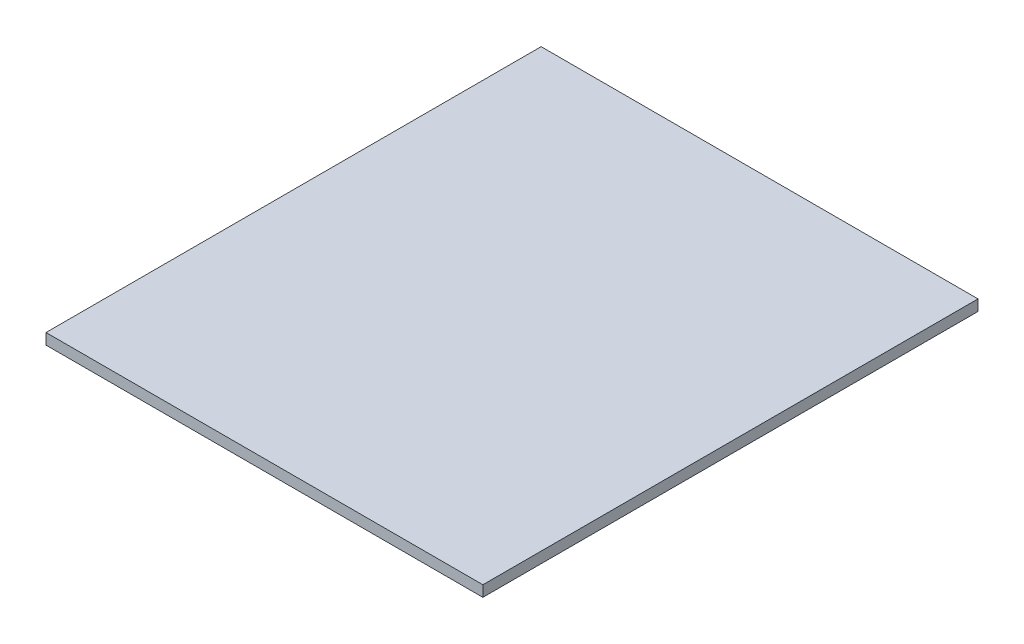
ISO-10303-21;
HEADER;
FILE_DESCRIPTION(('STEP AP214'),'2;1');
FILE_NAME('part.step','',(''),(''),'','','');
FILE_SCHEMA(('AUTOMOTIVE_DESIGN { 1 0 10303 214 1 1 1 1 }'));
ENDSEC;
DATA;
#1=APPLICATION_CONTEXT('core data for automotive mechanical design processes');
#2=APPLICATION_PROTOCOL_DEFINITION('international standard','automotive_design',2000,#1);
#3=PRODUCT_CONTEXT('',#1,'mechanical');
#4=PRODUCT('Part','Part','',(#3));
#5=PRODUCT_RELATED_PRODUCT_CATEGORY('part','',(#4));
#6=PRODUCT_DEFINITION_FORMATION('','',#4);
#7=PRODUCT_DEFINITION_CONTEXT('part definition',#1,'design');
#8=PRODUCT_DEFINITION('design','',#6,#7);
#9=PRODUCT_DEFINITION_SHAPE('','',#8);
#10=(LENGTH_UNIT() NAMED_UNIT(*) SI_UNIT(.MILLI.,.METRE.));
#11=(NAMED_UNIT(*) PLANE_ANGLE_UNIT() SI_UNIT($,.RADIAN.));
#12=(NAMED_UNIT(*) SI_UNIT($,.STERADIAN.) SOLID_ANGLE_UNIT());
#13=UNCERTAINTY_MEASURE_WITH_UNIT(LENGTH_MEASURE(1.E-05),#10,'distance_accuracy_value','');
#14=(GEOMETRIC_REPRESENTATION_CONTEXT(3) GLOBAL_UNCERTAINTY_ASSIGNED_CONTEXT((#13)) GLOBAL_UNIT_ASSIGNED_CONTEXT((#10,
#11,#12)) REPRESENTATION_CONTEXT('',''));
#15=CARTESIAN_POINT('',(0.,0.,0.));
#16=DIRECTION('',(0.,0.,1.));
#17=DIRECTION('',(1.,0.,0.));
#18=AXIS2_PLACEMENT_3D('',#15,#16,#17);
#19=CARTESIAN_POINT('',(0.,3.,0.));
#20=DIRECTION('',(1.,0.,0.));
#21=DIRECTION('',(0.,0.,-1.));
#22=AXIS2_PLACEMENT_3D('',#19,#20,#21);
#23=PLANE('',#22);
#24=DIRECTION('',(0.,0.,1.));
#25=VECTOR('',#24,1.);
#26=CARTESIAN_POINT('',(0.,0.,0.));
#27=LINE('',#26,#25);
#28=CARTESIAN_POINT('',(0.,0.,-136.));
#29=VERTEX_POINT('',#28);
#30=CARTESIAN_POINT('',(0.,0.,0.));
#31=VERTEX_POINT('',#30);
#32=EDGE_CURVE('E96',#29,#31,#27,.T.);
#33=ORIENTED_EDGE('',*,*,#32,.T.);
#34=DIRECTION('',(0.,-1.,0.));
#35=VECTOR('',#34,1.);
#36=CARTESIAN_POINT('',(0.,3.,0.));
#37=LINE('',#36,#35);
#38=CARTESIAN_POINT('',(0.,3.,0.));
#39=VERTEX_POINT('',#38);
#40=EDGE_CURVE('E11',#39,#31,#37,.T.);
#41=ORIENTED_EDGE('',*,*,#40,.F.);
#42=DIRECTION('',(0.,0.,1.));
#43=VECTOR('',#42,1.);
#44=CARTESIAN_POINT('',(0.,3.,0.));
#45=LINE('',#44,#43);
#46=CARTESIAN_POINT('',(0.,3.,-136.));
#47=VERTEX_POINT('',#46);
#48=EDGE_CURVE('E84',#47,#39,#45,.T.);
#49=ORIENTED_EDGE('',*,*,#48,.F.);
#50=DIRECTION('',(0.,-1.,0.));
#51=VECTOR('',#50,1.);
#52=CARTESIAN_POINT('',(0.,3.,-136.));
#53=LINE('',#52,#51);
#54=EDGE_CURVE('E92',#47,#29,#53,.T.);
#55=ORIENTED_EDGE('',*,*,#54,.T.);
#56=EDGE_LOOP('',(#33,#41,#49,#55));
#57=FACE_BOUND('',#56,.T.);
#58=ADVANCED_FACE('F33',(#57),#23,.F.);
#59=CARTESIAN_POINT('',(0.,3.,0.));
#60=DIRECTION('',(0.,0.,-1.));
#61=DIRECTION('',(-1.,0.,0.));
#62=AXIS2_PLACEMENT_3D('',#59,#60,#61);
#63=PLANE('',#62);
#64=DIRECTION('',(1.,0.,0.));
#65=VECTOR('',#64,1.);
#66=CARTESIAN_POINT('',(0.,0.,0.));
#67=LINE('',#66,#65);
#68=CARTESIAN_POINT('',(120.,0.,0.));
#69=VERTEX_POINT('',#68);
#70=EDGE_CURVE('E88',#31,#69,#67,.T.);
#71=ORIENTED_EDGE('',*,*,#70,.T.);
#72=DIRECTION('',(0.,-1.,0.));
#73=VECTOR('',#72,1.);
#74=CARTESIAN_POINT('',(120.,3.,0.));
#75=LINE('',#74,#73);
#76=CARTESIAN_POINT('',(120.,3.,0.));
#77=VERTEX_POINT('',#76);
#78=EDGE_CURVE('E41',#77,#69,#75,.T.);
#79=ORIENTED_EDGE('',*,*,#78,.F.);
#80=DIRECTION('',(1.,0.,0.));
#81=VECTOR('',#80,1.);
#82=CARTESIAN_POINT('',(0.,3.,0.));
#83=LINE('',#82,#81);
#84=EDGE_CURVE('E79',#39,#77,#83,.T.);
#85=ORIENTED_EDGE('',*,*,#84,.F.);
#86=ORIENTED_EDGE('',*,*,#40,.T.);
#87=EDGE_LOOP('',(#71,#79,#85,#86));
#88=FACE_BOUND('',#87,.T.);
#89=ADVANCED_FACE('F87',(#88),#63,.F.);
#90=CARTESIAN_POINT('',(120.,3.,0.));
#91=DIRECTION('',(-1.,0.,0.));
#92=DIRECTION('',(0.,0.,1.));
#93=AXIS2_PLACEMENT_3D('',#90,#91,#92);
#94=PLANE('',#93);
#95=DIRECTION('',(0.,0.,-1.));
#96=VECTOR('',#95,1.);
#97=CARTESIAN_POINT('',(120.,0.,0.));
#98=LINE('',#97,#96);
#99=CARTESIAN_POINT('',(120.,0.,-136.));
#100=VERTEX_POINT('',#99);
#101=EDGE_CURVE('E66',#69,#100,#98,.T.);
#102=ORIENTED_EDGE('',*,*,#101,.T.);
#103=DIRECTION('',(0.,-1.,0.));
#104=VECTOR('',#103,1.);
#105=CARTESIAN_POINT('',(120.,3.,-136.));
#106=LINE('',#105,#104);
#107=CARTESIAN_POINT('',(120.,3.,-136.));
#108=VERTEX_POINT('',#107);
#109=EDGE_CURVE('E89',#108,#100,#106,.T.);
#110=ORIENTED_EDGE('',*,*,#109,.F.);
#111=DIRECTION('',(0.,0.,-1.));
#112=VECTOR('',#111,1.);
#113=CARTESIAN_POINT('',(120.,3.,0.));
#114=LINE('',#113,#112);
#115=EDGE_CURVE('E82',#77,#108,#114,.T.);
#116=ORIENTED_EDGE('',*,*,#115,.F.);
#117=ORIENTED_EDGE('',*,*,#78,.T.);
#118=EDGE_LOOP('',(#102,#110,#116,#117));
#119=FACE_BOUND('',#118,.T.);
#120=ADVANCED_FACE('F90',(#119),#94,.F.);
#121=CARTESIAN_POINT('',(0.,3.,-136.));
#122=DIRECTION('',(0.,0.,1.));
#123=DIRECTION('',(1.,0.,0.));
#124=AXIS2_PLACEMENT_3D('',#121,#122,#123);
#125=PLANE('',#124);
#126=DIRECTION('',(-1.,0.,0.));
#127=VECTOR('',#126,1.);
#128=CARTESIAN_POINT('',(0.,0.,-136.));
#129=LINE('',#128,#127);
#130=EDGE_CURVE('E72',#100,#29,#129,.T.);
#131=ORIENTED_EDGE('',*,*,#130,.T.);
#132=ORIENTED_EDGE('',*,*,#54,.F.);
#133=DIRECTION('',(-1.,0.,0.));
#134=VECTOR('',#133,1.);
#135=CARTESIAN_POINT('',(0.,3.,-136.));
#136=LINE('',#135,#134);
#137=EDGE_CURVE('E49',#108,#47,#136,.T.);
#138=ORIENTED_EDGE('',*,*,#137,.F.);
#139=ORIENTED_EDGE('',*,*,#109,.T.);
#140=EDGE_LOOP('',(#131,#132,#138,#139));
#141=FACE_BOUND('',#140,.T.);
#142=ADVANCED_FACE('F103',(#141),#125,.F.);
#143=CARTESIAN_POINT('',(0.,3.,0.));
#144=DIRECTION('',(0.,-1.,0.));
#145=DIRECTION('',(0.,0.,-1.));
#146=AXIS2_PLACEMENT_3D('',#143,#144,#145);
#147=PLANE('',#146);
#148=ORIENTED_EDGE('',*,*,#48,.T.);
#149=ORIENTED_EDGE('',*,*,#84,.T.);
#150=ORIENTED_EDGE('',*,*,#115,.T.);
#151=ORIENTED_EDGE('',*,*,#137,.T.);
#152=EDGE_LOOP('',(#148,#149,#150,#151));
#153=FACE_BOUND('',#152,.T.);
#154=ADVANCED_FACE('F80',(#153),#147,.F.);
#155=CARTESIAN_POINT('',(0.,0.,0.));
#156=DIRECTION('',(0.,-1.,0.));
#157=DIRECTION('',(0.,0.,-1.));
#158=AXIS2_PLACEMENT_3D('',#155,#156,#157);
#159=PLANE('',#158);
#160=ORIENTED_EDGE('',*,*,#32,.F.);
#161=ORIENTED_EDGE('',*,*,#130,.F.);
#162=ORIENTED_EDGE('',*,*,#101,.F.);
#163=ORIENTED_EDGE('',*,*,#70,.F.);
#164=EDGE_LOOP('',(#160,#161,#162,#163));
#165=FACE_BOUND('',#164,.T.);
#166=ADVANCED_FACE('F106',(#165),#159,.T.);
#167=CLOSED_SHELL('',(#58,#89,#120,#142,#154,#166));
#168=MANIFOLD_SOLID_BREP('B2',#167);
#169=ADVANCED_BREP_SHAPE_REPRESENTATION('',(#18,#168),#14);
#170=SHAPE_DEFINITION_REPRESENTATION(#9,#169);
ENDSEC;
END-ISO-10303-21;
